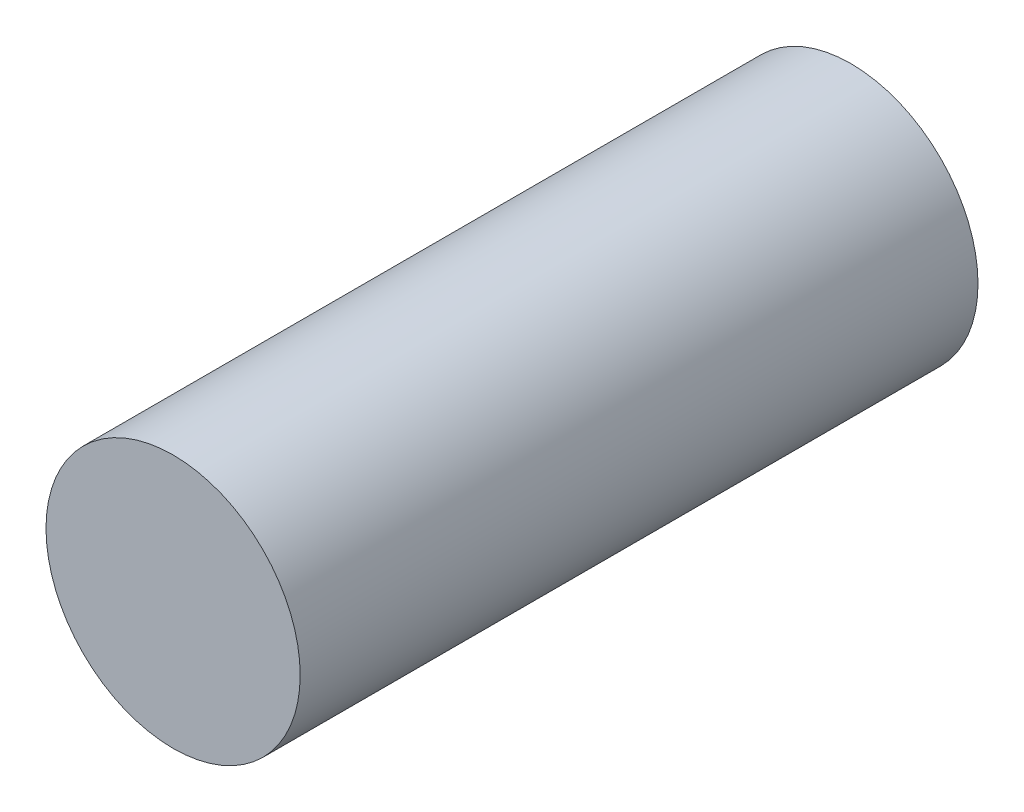
ISO-10303-21;
HEADER;
FILE_DESCRIPTION(('STEP AP214'),'2;1');
FILE_NAME('part.step','',(''),(''),'','','');
FILE_SCHEMA(('AUTOMOTIVE_DESIGN { 1 0 10303 214 1 1 1 1 }'));
ENDSEC;
DATA;
#1=APPLICATION_CONTEXT('core data for automotive mechanical design processes');
#2=APPLICATION_PROTOCOL_DEFINITION('international standard','automotive_design',2000,#1);
#3=PRODUCT_CONTEXT('',#1,'mechanical');
#4=PRODUCT('Part','Part','',(#3));
#5=PRODUCT_RELATED_PRODUCT_CATEGORY('part','',(#4));
#6=PRODUCT_DEFINITION_FORMATION('','',#4);
#7=PRODUCT_DEFINITION_CONTEXT('part definition',#1,'design');
#8=PRODUCT_DEFINITION('design','',#6,#7);
#9=PRODUCT_DEFINITION_SHAPE('','',#8);
#10=(LENGTH_UNIT() NAMED_UNIT(*) SI_UNIT(.MILLI.,.METRE.));
#11=(NAMED_UNIT(*) PLANE_ANGLE_UNIT() SI_UNIT($,.RADIAN.));
#12=(NAMED_UNIT(*) SI_UNIT($,.STERADIAN.) SOLID_ANGLE_UNIT());
#13=UNCERTAINTY_MEASURE_WITH_UNIT(LENGTH_MEASURE(1.E-05),#10,'distance_accuracy_value','');
#14=(GEOMETRIC_REPRESENTATION_CONTEXT(3) GLOBAL_UNCERTAINTY_ASSIGNED_CONTEXT((#13)) GLOBAL_UNIT_ASSIGNED_CONTEXT((#10,
#11,#12)) REPRESENTATION_CONTEXT('',''));
#15=CARTESIAN_POINT('',(0.,0.,0.));
#16=DIRECTION('',(0.,0.,1.));
#17=DIRECTION('',(1.,0.,0.));
#18=AXIS2_PLACEMENT_3D('',#15,#16,#17);
#19=CARTESIAN_POINT('',(-117.3,42.3,-10.));
#20=DIRECTION('',(0.,0.,1.));
#21=DIRECTION('',(1.,0.,0.));
#22=AXIS2_PLACEMENT_3D('',#19,#20,#21);
#23=CYLINDRICAL_SURFACE('',#22,3.75000000000001);
#24=CARTESIAN_POINT('',(-117.3,42.3,-10.));
#25=DIRECTION('',(0.,0.,1.));
#26=DIRECTION('',(1.,0.,0.));
#27=AXIS2_PLACEMENT_3D('',#24,#25,#26);
#28=CIRCLE('',#27,3.75000000000001);
#29=CARTESIAN_POINT('',(-113.55,42.3,-10.));
#30=VERTEX_POINT('',#29);
#31=EDGE_CURVE('E41',#30,#30,#28,.T.);
#32=ORIENTED_EDGE('',*,*,#31,.T.);
#33=EDGE_LOOP('',(#32));
#34=FACE_BOUND('',#33,.T.);
#35=CARTESIAN_POINT('',(-117.3,42.3,10.));
#36=DIRECTION('',(0.,0.,1.));
#37=DIRECTION('',(1.,0.,0.));
#38=AXIS2_PLACEMENT_3D('',#35,#36,#37);
#39=CIRCLE('',#38,3.75000000000001);
#40=CARTESIAN_POINT('',(-113.55,42.3,10.));
#41=VERTEX_POINT('',#40);
#42=EDGE_CURVE('E10',#41,#41,#39,.T.);
#43=ORIENTED_EDGE('',*,*,#42,.F.);
#44=EDGE_LOOP('',(#43));
#45=FACE_BOUND('',#44,.T.);
#46=ADVANCED_FACE('F34',(#34,#45),#23,.T.);
#47=CARTESIAN_POINT('',(0.,0.,-10.));
#48=DIRECTION('',(0.,0.,1.));
#49=DIRECTION('',(1.,0.,0.));
#50=AXIS2_PLACEMENT_3D('',#47,#48,#49);
#51=PLANE('',#50);
#52=ORIENTED_EDGE('',*,*,#31,.F.);
#53=EDGE_LOOP('',(#52));
#54=FACE_BOUND('',#53,.T.);
#55=ADVANCED_FACE('F49',(#54),#51,.F.);
#56=CARTESIAN_POINT('',(0.,0.,10.));
#57=DIRECTION('',(0.,0.,1.));
#58=DIRECTION('',(1.,0.,0.));
#59=AXIS2_PLACEMENT_3D('',#56,#57,#58);
#60=PLANE('',#59);
#61=ORIENTED_EDGE('',*,*,#42,.T.);
#62=EDGE_LOOP('',(#61));
#63=FACE_BOUND('',#62,.T.);
#64=ADVANCED_FACE('F36',(#63),#60,.T.);
#65=CLOSED_SHELL('',(#46,#55,#64));
#66=MANIFOLD_SOLID_BREP('B2',#65);
#67=ADVANCED_BREP_SHAPE_REPRESENTATION('',(#18,#66),#14);
#68=SHAPE_DEFINITION_REPRESENTATION(#9,#67);
ENDSEC;
END-ISO-10303-21;
